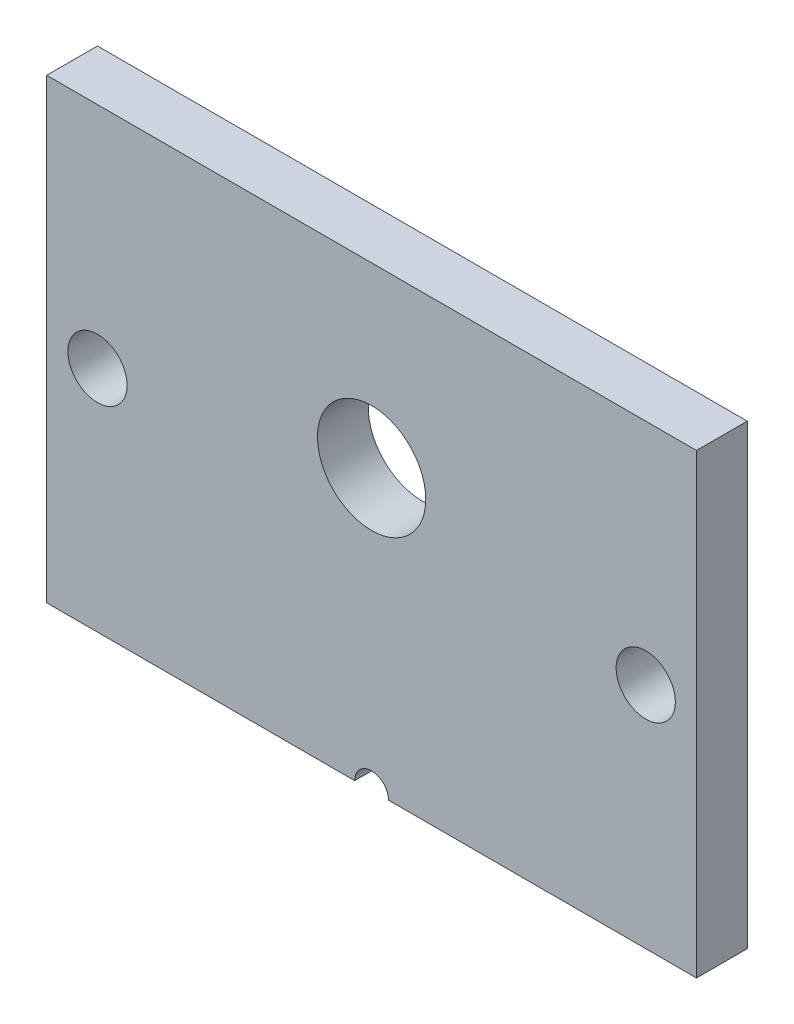
ISO-10303-21;
HEADER;
FILE_DESCRIPTION(('STEP AP214'),'2;1');
FILE_NAME('part.step','',(''),(''),'','','');
FILE_SCHEMA(('AUTOMOTIVE_DESIGN { 1 0 10303 214 1 1 1 1 }'));
ENDSEC;
DATA;
#1=APPLICATION_CONTEXT('core data for automotive mechanical design processes');
#2=APPLICATION_PROTOCOL_DEFINITION('international standard','automotive_design',2000,#1);
#3=PRODUCT_CONTEXT('',#1,'mechanical');
#4=PRODUCT('Part','Part','',(#3));
#5=PRODUCT_RELATED_PRODUCT_CATEGORY('part','',(#4));
#6=PRODUCT_DEFINITION_FORMATION('','',#4);
#7=PRODUCT_DEFINITION_CONTEXT('part definition',#1,'design');
#8=PRODUCT_DEFINITION('design','',#6,#7);
#9=PRODUCT_DEFINITION_SHAPE('','',#8);
#10=(LENGTH_UNIT() NAMED_UNIT(*) SI_UNIT(.MILLI.,.METRE.));
#11=(NAMED_UNIT(*) PLANE_ANGLE_UNIT() SI_UNIT($,.RADIAN.));
#12=(NAMED_UNIT(*) SI_UNIT($,.STERADIAN.) SOLID_ANGLE_UNIT());
#13=UNCERTAINTY_MEASURE_WITH_UNIT(LENGTH_MEASURE(1.E-05),#10,'distance_accuracy_value','');
#14=(GEOMETRIC_REPRESENTATION_CONTEXT(3) GLOBAL_UNCERTAINTY_ASSIGNED_CONTEXT((#13)) GLOBAL_UNIT_ASSIGNED_CONTEXT((#10,
#11,#12)) REPRESENTATION_CONTEXT('',''));
#15=CARTESIAN_POINT('',(0.,0.,0.));
#16=DIRECTION('',(0.,0.,1.));
#17=DIRECTION('',(1.,0.,0.));
#18=AXIS2_PLACEMENT_3D('',#15,#16,#17);
#19=CARTESIAN_POINT('',(-19.2,-13.5,3.));
#20=DIRECTION('',(0.,1.,0.));
#21=DIRECTION('',(0.,0.,1.));
#22=AXIS2_PLACEMENT_3D('',#19,#20,#21);
#23=PLANE('',#22);
#24=DIRECTION('',(1.,0.,0.));
#25=VECTOR('',#24,1.);
#26=CARTESIAN_POINT('',(-19.2,-13.5,0.));
#27=LINE('',#26,#25);
#28=CARTESIAN_POINT('',(-19.2,-13.5,0.));
#29=VERTEX_POINT('',#28);
#30=CARTESIAN_POINT('',(-1.,-13.5,0.));
#31=VERTEX_POINT('',#30);
#32=EDGE_CURVE('E109',#29,#31,#27,.T.);
#33=ORIENTED_EDGE('',*,*,#32,.T.);
#34=DIRECTION('',(0.,0.,1.));
#35=VECTOR('',#34,1.);
#36=CARTESIAN_POINT('',(-1.,-13.5,0.));
#37=LINE('',#36,#35);
#38=CARTESIAN_POINT('',(-1.,-13.5,3.));
#39=VERTEX_POINT('',#38);
#40=EDGE_CURVE('E49',#31,#39,#37,.T.);
#41=ORIENTED_EDGE('',*,*,#40,.T.);
#42=DIRECTION('',(1.,0.,0.));
#43=VECTOR('',#42,1.);
#44=CARTESIAN_POINT('',(-19.2,-13.5,3.));
#45=LINE('',#44,#43);
#46=CARTESIAN_POINT('',(-19.2,-13.5,3.));
#47=VERTEX_POINT('',#46);
#48=EDGE_CURVE('E120',#47,#39,#45,.T.);
#49=ORIENTED_EDGE('',*,*,#48,.F.);
#50=DIRECTION('',(0.,0.,-1.));
#51=VECTOR('',#50,1.);
#52=CARTESIAN_POINT('',(-19.2,-13.5,3.));
#53=LINE('',#52,#51);
#54=EDGE_CURVE('E119',#47,#29,#53,.T.);
#55=ORIENTED_EDGE('',*,*,#54,.T.);
#56=EDGE_LOOP('',(#33,#41,#49,#55));
#57=FACE_BOUND('',#56,.T.);
#58=ADVANCED_FACE('F34',(#57),#23,.F.);
#59=CARTESIAN_POINT('',(19.2,-13.5,3.));
#60=DIRECTION('',(-1.,0.,0.));
#61=DIRECTION('',(0.,0.,1.));
#62=AXIS2_PLACEMENT_3D('',#59,#60,#61);
#63=PLANE('',#62);
#64=DIRECTION('',(0.,1.,0.));
#65=VECTOR('',#64,1.);
#66=CARTESIAN_POINT('',(19.2,-13.5,0.));
#67=LINE('',#66,#65);
#68=CARTESIAN_POINT('',(19.2,-13.5,0.));
#69=VERTEX_POINT('',#68);
#70=CARTESIAN_POINT('',(19.2,13.5,0.));
#71=VERTEX_POINT('',#70);
#72=EDGE_CURVE('E108',#69,#71,#67,.T.);
#73=ORIENTED_EDGE('',*,*,#72,.T.);
#74=DIRECTION('',(0.,0.,-1.));
#75=VECTOR('',#74,1.);
#76=CARTESIAN_POINT('',(19.2,13.5,3.));
#77=LINE('',#76,#75);
#78=CARTESIAN_POINT('',(19.2,13.5,3.));
#79=VERTEX_POINT('',#78);
#80=EDGE_CURVE('E11',#79,#71,#77,.T.);
#81=ORIENTED_EDGE('',*,*,#80,.F.);
#82=DIRECTION('',(0.,1.,0.));
#83=VECTOR('',#82,1.);
#84=CARTESIAN_POINT('',(19.2,-13.5,3.));
#85=LINE('',#84,#83);
#86=CARTESIAN_POINT('',(19.2,-13.5,3.));
#87=VERTEX_POINT('',#86);
#88=EDGE_CURVE('E112',#87,#79,#85,.T.);
#89=ORIENTED_EDGE('',*,*,#88,.F.);
#90=DIRECTION('',(0.,0.,-1.));
#91=VECTOR('',#90,1.);
#92=CARTESIAN_POINT('',(19.2,-13.5,3.));
#93=LINE('',#92,#91);
#94=EDGE_CURVE('E117',#87,#69,#93,.T.);
#95=ORIENTED_EDGE('',*,*,#94,.T.);
#96=EDGE_LOOP('',(#73,#81,#89,#95));
#97=FACE_BOUND('',#96,.T.);
#98=ADVANCED_FACE('F36',(#97),#63,.F.);
#99=CARTESIAN_POINT('',(-19.2,13.5,3.));
#100=DIRECTION('',(0.,-1.,0.));
#101=DIRECTION('',(0.,0.,-1.));
#102=AXIS2_PLACEMENT_3D('',#99,#100,#101);
#103=PLANE('',#102);
#104=DIRECTION('',(-1.,0.,0.));
#105=VECTOR('',#104,1.);
#106=CARTESIAN_POINT('',(-19.2,13.5,0.));
#107=LINE('',#106,#105);
#108=CARTESIAN_POINT('',(-19.2,13.5,0.));
#109=VERTEX_POINT('',#108);
#110=EDGE_CURVE('E113',#71,#109,#107,.T.);
#111=ORIENTED_EDGE('',*,*,#110,.T.);
#112=DIRECTION('',(0.,0.,-1.));
#113=VECTOR('',#112,1.);
#114=CARTESIAN_POINT('',(-19.2,13.5,3.));
#115=LINE('',#114,#113);
#116=CARTESIAN_POINT('',(-19.2,13.5,3.));
#117=VERTEX_POINT('',#116);
#118=EDGE_CURVE('E42',#117,#109,#115,.T.);
#119=ORIENTED_EDGE('',*,*,#118,.F.);
#120=DIRECTION('',(-1.,0.,0.));
#121=VECTOR('',#120,1.);
#122=CARTESIAN_POINT('',(-19.2,13.5,3.));
#123=LINE('',#122,#121);
#124=EDGE_CURVE('E87',#79,#117,#123,.T.);
#125=ORIENTED_EDGE('',*,*,#124,.F.);
#126=ORIENTED_EDGE('',*,*,#80,.T.);
#127=EDGE_LOOP('',(#111,#119,#125,#126));
#128=FACE_BOUND('',#127,.T.);
#129=ADVANCED_FACE('F137',(#128),#103,.F.);
#130=CARTESIAN_POINT('',(-19.2,-13.5,3.));
#131=DIRECTION('',(1.,0.,0.));
#132=DIRECTION('',(0.,0.,-1.));
#133=AXIS2_PLACEMENT_3D('',#130,#131,#132);
#134=PLANE('',#133);
#135=DIRECTION('',(0.,-1.,0.));
#136=VECTOR('',#135,1.);
#137=CARTESIAN_POINT('',(-19.2,-13.5,0.));
#138=LINE('',#137,#136);
#139=EDGE_CURVE('E110',#109,#29,#138,.T.);
#140=ORIENTED_EDGE('',*,*,#139,.T.);
#141=ORIENTED_EDGE('',*,*,#54,.F.);
#142=DIRECTION('',(0.,-1.,0.));
#143=VECTOR('',#142,1.);
#144=CARTESIAN_POINT('',(-19.2,-13.5,3.));
#145=LINE('',#144,#143);
#146=EDGE_CURVE('E128',#117,#47,#145,.T.);
#147=ORIENTED_EDGE('',*,*,#146,.F.);
#148=ORIENTED_EDGE('',*,*,#118,.T.);
#149=EDGE_LOOP('',(#140,#141,#147,#148));
#150=FACE_BOUND('',#149,.T.);
#151=ADVANCED_FACE('F126',(#150),#134,.F.);
#152=CARTESIAN_POINT('',(1.,-13.5,3.));
#153=VERTEX_POINT('',#152);
#154=EDGE_CURVE('E58',#153,#87,#45,.T.);
#155=ORIENTED_EDGE('',*,*,#154,.F.);
#156=DIRECTION('',(0.,0.,1.));
#157=VECTOR('',#156,1.);
#158=CARTESIAN_POINT('',(1.,-13.5,0.));
#159=LINE('',#158,#157);
#160=CARTESIAN_POINT('',(1.,-13.5,0.));
#161=VERTEX_POINT('',#160);
#162=EDGE_CURVE('E96',#153,#161,#159,.F.);
#163=ORIENTED_EDGE('',*,*,#162,.T.);
#164=EDGE_CURVE('E80',#161,#69,#27,.T.);
#165=ORIENTED_EDGE('',*,*,#164,.T.);
#166=ORIENTED_EDGE('',*,*,#94,.F.);
#167=EDGE_LOOP('',(#155,#163,#165,#166));
#168=FACE_BOUND('',#167,.T.);
#169=ADVANCED_FACE('F102',(#168),#23,.F.);
#170=CARTESIAN_POINT('',(0.,0.,3.));
#171=DIRECTION('',(0.,0.,-1.));
#172=DIRECTION('',(-1.,0.,0.));
#173=AXIS2_PLACEMENT_3D('',#170,#171,#172);
#174=PLANE('',#173);
#175=CARTESIAN_POINT('',(0.,3.,3.));
#176=DIRECTION('',(0.,0.,1.));
#177=DIRECTION('',(1.,0.,0.));
#178=AXIS2_PLACEMENT_3D('',#175,#176,#177);
#179=CIRCLE('',#178,3.2);
#180=CARTESIAN_POINT('',(3.2,3.,3.));
#181=VERTEX_POINT('',#180);
#182=EDGE_CURVE('E155',#181,#181,#179,.T.);
#183=ORIENTED_EDGE('',*,*,#182,.F.);
#184=EDGE_LOOP('',(#183));
#185=FACE_BOUND('',#184,.T.);
#186=CARTESIAN_POINT('',(-16.2,0.,3.));
#187=DIRECTION('',(0.,0.,1.));
#188=DIRECTION('',(1.,0.,0.));
#189=AXIS2_PLACEMENT_3D('',#186,#187,#188);
#190=CIRCLE('',#189,1.75);
#191=CARTESIAN_POINT('',(-14.45,0.,3.));
#192=VERTEX_POINT('',#191);
#193=EDGE_CURVE('E146',#192,#192,#190,.T.);
#194=ORIENTED_EDGE('',*,*,#193,.F.);
#195=EDGE_LOOP('',(#194));
#196=FACE_BOUND('',#195,.T.);
#197=CARTESIAN_POINT('',(16.2,0.,3.));
#198=DIRECTION('',(0.,0.,1.));
#199=DIRECTION('',(1.,0.,0.));
#200=AXIS2_PLACEMENT_3D('',#197,#198,#199);
#201=CIRCLE('',#200,1.75);
#202=CARTESIAN_POINT('',(17.95,0.,3.));
#203=VERTEX_POINT('',#202);
#204=EDGE_CURVE('E143',#203,#203,#201,.F.);
#205=ORIENTED_EDGE('',*,*,#204,.T.);
#206=EDGE_LOOP('',(#205));
#207=FACE_BOUND('',#206,.T.);
#208=ORIENTED_EDGE('',*,*,#48,.T.);
#209=CARTESIAN_POINT('',(0.,-13.5,3.));
#210=DIRECTION('',(0.,0.,1.));
#211=DIRECTION('',(1.,0.,0.));
#212=AXIS2_PLACEMENT_3D('',#209,#210,#211);
#213=CIRCLE('',#212,1.);
#214=EDGE_CURVE('E100',#153,#39,#213,.T.);
#215=ORIENTED_EDGE('',*,*,#214,.F.);
#216=ORIENTED_EDGE('',*,*,#154,.T.);
#217=ORIENTED_EDGE('',*,*,#88,.T.);
#218=ORIENTED_EDGE('',*,*,#124,.T.);
#219=ORIENTED_EDGE('',*,*,#146,.T.);
#220=EDGE_LOOP('',(#208,#215,#216,#217,#218,#219));
#221=FACE_BOUND('',#220,.T.);
#222=ADVANCED_FACE('F161',(#185,#196,#207,#221),#174,.F.);
#223=CARTESIAN_POINT('',(0.,0.,0.));
#224=DIRECTION('',(0.,0.,-1.));
#225=DIRECTION('',(-1.,0.,0.));
#226=AXIS2_PLACEMENT_3D('',#223,#224,#225);
#227=PLANE('',#226);
#228=CARTESIAN_POINT('',(0.,-13.5,0.));
#229=DIRECTION('',(0.,0.,1.));
#230=DIRECTION('',(1.,0.,0.));
#231=AXIS2_PLACEMENT_3D('',#228,#229,#230);
#232=CIRCLE('',#231,1.);
#233=EDGE_CURVE('E94',#161,#31,#232,.T.);
#234=ORIENTED_EDGE('',*,*,#233,.T.);
#235=ORIENTED_EDGE('',*,*,#32,.F.);
#236=ORIENTED_EDGE('',*,*,#139,.F.);
#237=ORIENTED_EDGE('',*,*,#110,.F.);
#238=ORIENTED_EDGE('',*,*,#72,.F.);
#239=ORIENTED_EDGE('',*,*,#164,.F.);
#240=EDGE_LOOP('',(#234,#235,#236,#237,#238,#239));
#241=FACE_BOUND('',#240,.T.);
#242=CARTESIAN_POINT('',(0.,3.,0.));
#243=DIRECTION('',(0.,0.,1.));
#244=DIRECTION('',(1.,0.,0.));
#245=AXIS2_PLACEMENT_3D('',#242,#243,#244);
#246=CIRCLE('',#245,3.2);
#247=CARTESIAN_POINT('',(3.2,3.,0.));
#248=VERTEX_POINT('',#247);
#249=EDGE_CURVE('E152',#248,#248,#246,.T.);
#250=ORIENTED_EDGE('',*,*,#249,.T.);
#251=EDGE_LOOP('',(#250));
#252=FACE_BOUND('',#251,.T.);
#253=CARTESIAN_POINT('',(-16.2,0.,0.));
#254=DIRECTION('',(0.,0.,1.));
#255=DIRECTION('',(1.,0.,0.));
#256=AXIS2_PLACEMENT_3D('',#253,#254,#255);
#257=CIRCLE('',#256,1.75);
#258=CARTESIAN_POINT('',(-14.45,0.,0.));
#259=VERTEX_POINT('',#258);
#260=EDGE_CURVE('E149',#259,#259,#257,.T.);
#261=ORIENTED_EDGE('',*,*,#260,.T.);
#262=EDGE_LOOP('',(#261));
#263=FACE_BOUND('',#262,.T.);
#264=CARTESIAN_POINT('',(16.2,0.,0.));
#265=DIRECTION('',(0.,0.,1.));
#266=DIRECTION('',(1.,0.,0.));
#267=AXIS2_PLACEMENT_3D('',#264,#265,#266);
#268=CIRCLE('',#267,1.75);
#269=CARTESIAN_POINT('',(17.95,0.,0.));
#270=VERTEX_POINT('',#269);
#271=EDGE_CURVE('E136',#270,#270,#268,.F.);
#272=ORIENTED_EDGE('',*,*,#271,.F.);
#273=EDGE_LOOP('',(#272));
#274=FACE_BOUND('',#273,.T.);
#275=ADVANCED_FACE('F105',(#241,#252,#263,#274),#227,.T.);
#276=CARTESIAN_POINT('',(16.2,0.,0.));
#277=DIRECTION('',(0.,0.,1.));
#278=DIRECTION('',(1.,0.,0.));
#279=AXIS2_PLACEMENT_3D('',#276,#277,#278);
#280=CYLINDRICAL_SURFACE('',#279,1.75);
#281=ORIENTED_EDGE('',*,*,#271,.T.);
#282=EDGE_LOOP('',(#281));
#283=FACE_BOUND('',#282,.T.);
#284=ORIENTED_EDGE('',*,*,#204,.F.);
#285=EDGE_LOOP('',(#284));
#286=FACE_BOUND('',#285,.T.);
#287=ADVANCED_FACE('F169',(#283,#286),#280,.F.);
#288=CARTESIAN_POINT('',(-16.2,0.,0.));
#289=DIRECTION('',(0.,0.,1.));
#290=DIRECTION('',(1.,0.,0.));
#291=AXIS2_PLACEMENT_3D('',#288,#289,#290);
#292=CYLINDRICAL_SURFACE('',#291,1.75);
#293=ORIENTED_EDGE('',*,*,#260,.F.);
#294=EDGE_LOOP('',(#293));
#295=FACE_BOUND('',#294,.T.);
#296=ORIENTED_EDGE('',*,*,#193,.T.);
#297=EDGE_LOOP('',(#296));
#298=FACE_BOUND('',#297,.T.);
#299=ADVANCED_FACE('F215',(#295,#298),#292,.F.);
#300=CARTESIAN_POINT('',(0.,3.,0.));
#301=DIRECTION('',(0.,0.,1.));
#302=DIRECTION('',(1.,0.,0.));
#303=AXIS2_PLACEMENT_3D('',#300,#301,#302);
#304=CYLINDRICAL_SURFACE('',#303,3.2);
#305=ORIENTED_EDGE('',*,*,#249,.F.);
#306=EDGE_LOOP('',(#305));
#307=FACE_BOUND('',#306,.T.);
#308=ORIENTED_EDGE('',*,*,#182,.T.);
#309=EDGE_LOOP('',(#308));
#310=FACE_BOUND('',#309,.T.);
#311=ADVANCED_FACE('F221',(#307,#310),#304,.F.);
#312=CARTESIAN_POINT('',(0.,-13.5,0.));
#313=DIRECTION('',(0.,0.,1.));
#314=DIRECTION('',(1.,0.,0.));
#315=AXIS2_PLACEMENT_3D('',#312,#313,#314);
#316=CYLINDRICAL_SURFACE('',#315,1.);
#317=ORIENTED_EDGE('',*,*,#233,.F.);
#318=ORIENTED_EDGE('',*,*,#162,.F.);
#319=ORIENTED_EDGE('',*,*,#214,.T.);
#320=ORIENTED_EDGE('',*,*,#40,.F.);
#321=EDGE_LOOP('',(#317,#318,#319,#320));
#322=FACE_BOUND('',#321,.T.);
#323=ADVANCED_FACE('F95',(#322),#316,.F.);
#324=CLOSED_SHELL('',(#58,#98,#129,#151,#169,#222,#275,#287,#299,#311,#323));
#325=MANIFOLD_SOLID_BREP('B2',#324);
#326=ADVANCED_BREP_SHAPE_REPRESENTATION('',(#18,#325),#14);
#327=SHAPE_DEFINITION_REPRESENTATION(#9,#326);
ENDSEC;
END-ISO-10303-21;
